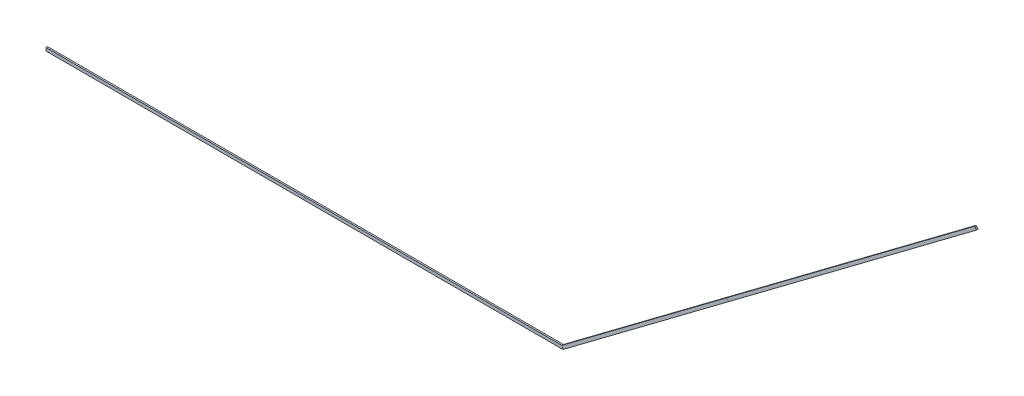
ISO-10303-21;
HEADER;
FILE_DESCRIPTION(('STEP AP214'),'2;1');
FILE_NAME('part.step','',(''),(''),'','','');
FILE_SCHEMA(('AUTOMOTIVE_DESIGN { 1 0 10303 214 1 1 1 1 }'));
ENDSEC;
DATA;
#1=APPLICATION_CONTEXT('core data for automotive mechanical design processes');
#2=APPLICATION_PROTOCOL_DEFINITION('international standard','automotive_design',2000,#1);
#3=PRODUCT_CONTEXT('',#1,'mechanical');
#4=PRODUCT('Part','Part','',(#3));
#5=PRODUCT_RELATED_PRODUCT_CATEGORY('part','',(#4));
#6=PRODUCT_DEFINITION_FORMATION('','',#4);
#7=PRODUCT_DEFINITION_CONTEXT('part definition',#1,'design');
#8=PRODUCT_DEFINITION('design','',#6,#7);
#9=PRODUCT_DEFINITION_SHAPE('','',#8);
#10=(LENGTH_UNIT() NAMED_UNIT(*) SI_UNIT(.MILLI.,.METRE.));
#11=(NAMED_UNIT(*) PLANE_ANGLE_UNIT() SI_UNIT($,.RADIAN.));
#12=(NAMED_UNIT(*) SI_UNIT($,.STERADIAN.) SOLID_ANGLE_UNIT());
#13=UNCERTAINTY_MEASURE_WITH_UNIT(LENGTH_MEASURE(1.E-05),#10,'distance_accuracy_value','');
#14=(GEOMETRIC_REPRESENTATION_CONTEXT(3) GLOBAL_UNCERTAINTY_ASSIGNED_CONTEXT((#13)) GLOBAL_UNIT_ASSIGNED_CONTEXT((#10,
#11,#12)) REPRESENTATION_CONTEXT('',''));
#15=CARTESIAN_POINT('',(0.,0.,0.));
#16=DIRECTION('',(0.,0.,1.));
#17=DIRECTION('',(1.,0.,0.));
#18=AXIS2_PLACEMENT_3D('',#15,#16,#17);
#19=CARTESIAN_POINT('',(9009.,2988.,-7.5));
#20=DIRECTION('',(0.,0.,1.));
#21=DIRECTION('',(1.,0.,0.));
#22=AXIS2_PLACEMENT_3D('',#19,#20,#21);
#23=PLANE('',#22);
#24=DIRECTION('',(-0.600000000000015,0.799999999999989,0.));
#25=VECTOR('',#24,1.);
#26=CARTESIAN_POINT('',(6609.,1188.,-7.5));
#27=LINE('',#26,#25);
#28=CARTESIAN_POINT('',(6609.,1188.,-7.5));
#29=VERTEX_POINT('',#28);
#30=CARTESIAN_POINT('',(6591.,1212.,-7.5));
#31=VERTEX_POINT('',#30);
#32=EDGE_CURVE('E115',#29,#31,#27,.T.);
#33=ORIENTED_EDGE('',*,*,#32,.T.);
#34=DIRECTION('',(-0.8,-0.6,0.));
#35=VECTOR('',#34,1.);
#36=CARTESIAN_POINT('',(8991.,3012.,-7.5));
#37=LINE('',#36,#35);
#38=CARTESIAN_POINT('',(8991.,3012.,-7.5));
#39=VERTEX_POINT('',#38);
#40=EDGE_CURVE('E12',#39,#31,#37,.T.);
#41=ORIENTED_EDGE('',*,*,#40,.F.);
#42=DIRECTION('',(-0.600000000000015,0.799999999999989,0.));
#43=VECTOR('',#42,1.);
#44=CARTESIAN_POINT('',(9009.,2988.,-7.5));
#45=LINE('',#44,#43);
#46=CARTESIAN_POINT('',(9009.,2988.,-7.5));
#47=VERTEX_POINT('',#46);
#48=EDGE_CURVE('E103',#47,#39,#45,.T.);
#49=ORIENTED_EDGE('',*,*,#48,.F.);
#50=DIRECTION('',(-0.8,-0.6,0.));
#51=VECTOR('',#50,1.);
#52=CARTESIAN_POINT('',(9009.,2988.,-7.5));
#53=LINE('',#52,#51);
#54=EDGE_CURVE('E111',#47,#29,#53,.T.);
#55=ORIENTED_EDGE('',*,*,#54,.T.);
#56=EDGE_LOOP('',(#33,#41,#49,#55));
#57=FACE_BOUND('',#56,.T.);
#58=ADVANCED_FACE('F52',(#57),#23,.F.);
#59=CARTESIAN_POINT('',(8991.,3012.,7.5));
#60=DIRECTION('',(0.6,-0.8,0.));
#61=DIRECTION('',(0.8,0.6,0.));
#62=AXIS2_PLACEMENT_3D('',#59,#60,#61);
#63=PLANE('',#62);
#64=DIRECTION('',(0.,0.,1.));
#65=VECTOR('',#64,1.);
#66=CARTESIAN_POINT('',(6591.,1212.,7.5));
#67=LINE('',#66,#65);
#68=CARTESIAN_POINT('',(6591.,1212.,7.5));
#69=VERTEX_POINT('',#68);
#70=EDGE_CURVE('E107',#31,#69,#67,.T.);
#71=ORIENTED_EDGE('',*,*,#70,.T.);
#72=DIRECTION('',(-0.8,-0.6,0.));
#73=VECTOR('',#72,1.);
#74=CARTESIAN_POINT('',(8991.,3012.,7.5));
#75=LINE('',#74,#73);
#76=CARTESIAN_POINT('',(8991.,3012.,7.5));
#77=VERTEX_POINT('',#76);
#78=EDGE_CURVE('E60',#77,#69,#75,.T.);
#79=ORIENTED_EDGE('',*,*,#78,.F.);
#80=DIRECTION('',(0.,0.,1.));
#81=VECTOR('',#80,1.);
#82=CARTESIAN_POINT('',(8991.,3012.,7.5));
#83=LINE('',#82,#81);
#84=EDGE_CURVE('E98',#39,#77,#83,.T.);
#85=ORIENTED_EDGE('',*,*,#84,.F.);
#86=ORIENTED_EDGE('',*,*,#40,.T.);
#87=EDGE_LOOP('',(#71,#79,#85,#86));
#88=FACE_BOUND('',#87,.T.);
#89=ADVANCED_FACE('F106',(#88),#63,.F.);
#90=CARTESIAN_POINT('',(9009.,2988.,7.5));
#91=DIRECTION('',(0.,0.,-1.));
#92=DIRECTION('',(-1.,0.,0.));
#93=AXIS2_PLACEMENT_3D('',#90,#91,#92);
#94=PLANE('',#93);
#95=DIRECTION('',(0.600000000000015,-0.799999999999989,0.));
#96=VECTOR('',#95,1.);
#97=CARTESIAN_POINT('',(6609.,1188.,7.5));
#98=LINE('',#97,#96);
#99=CARTESIAN_POINT('',(6609.,1188.,7.5));
#100=VERTEX_POINT('',#99);
#101=EDGE_CURVE('E85',#69,#100,#98,.T.);
#102=ORIENTED_EDGE('',*,*,#101,.T.);
#103=DIRECTION('',(-0.8,-0.6,0.));
#104=VECTOR('',#103,1.);
#105=CARTESIAN_POINT('',(9009.,2988.,7.5));
#106=LINE('',#105,#104);
#107=CARTESIAN_POINT('',(9009.,2988.,7.5));
#108=VERTEX_POINT('',#107);
#109=EDGE_CURVE('E108',#108,#100,#106,.T.);
#110=ORIENTED_EDGE('',*,*,#109,.F.);
#111=DIRECTION('',(0.600000000000015,-0.799999999999989,0.));
#112=VECTOR('',#111,1.);
#113=CARTESIAN_POINT('',(9009.,2988.,7.5));
#114=LINE('',#113,#112);
#115=EDGE_CURVE('E101',#77,#108,#114,.T.);
#116=ORIENTED_EDGE('',*,*,#115,.F.);
#117=ORIENTED_EDGE('',*,*,#78,.T.);
#118=EDGE_LOOP('',(#102,#110,#116,#117));
#119=FACE_BOUND('',#118,.T.);
#120=ADVANCED_FACE('F109',(#119),#94,.F.);
#121=CARTESIAN_POINT('',(9009.,2988.,7.5));
#122=DIRECTION('',(-0.6,0.8,0.));
#123=DIRECTION('',(-0.8,-0.6,0.));
#124=AXIS2_PLACEMENT_3D('',#121,#122,#123);
#125=PLANE('',#124);
#126=DIRECTION('',(0.,0.,-1.));
#127=VECTOR('',#126,1.);
#128=CARTESIAN_POINT('',(6609.,1188.,7.5));
#129=LINE('',#128,#127);
#130=EDGE_CURVE('E91',#100,#29,#129,.T.);
#131=ORIENTED_EDGE('',*,*,#130,.T.);
#132=ORIENTED_EDGE('',*,*,#54,.F.);
#133=DIRECTION('',(0.,0.,-1.));
#134=VECTOR('',#133,1.);
#135=CARTESIAN_POINT('',(9009.,2988.,7.5));
#136=LINE('',#135,#134);
#137=EDGE_CURVE('E68',#108,#47,#136,.T.);
#138=ORIENTED_EDGE('',*,*,#137,.F.);
#139=ORIENTED_EDGE('',*,*,#109,.T.);
#140=EDGE_LOOP('',(#131,#132,#138,#139));
#141=FACE_BOUND('',#140,.T.);
#142=ADVANCED_FACE('F122',(#141),#125,.F.);
#143=CARTESIAN_POINT('',(7199.99999999991,5400.00000000003,0.));
#144=DIRECTION('',(-0.799999999999989,-0.600000000000015,0.));
#145=DIRECTION('',(0.600000000000015,-0.799999999999989,0.));
#146=AXIS2_PLACEMENT_3D('',#143,#144,#145);
#147=PLANE('',#146);
#148=ORIENTED_EDGE('',*,*,#48,.T.);
#149=ORIENTED_EDGE('',*,*,#84,.T.);
#150=ORIENTED_EDGE('',*,*,#115,.T.);
#151=ORIENTED_EDGE('',*,*,#137,.T.);
#152=EDGE_LOOP('',(#148,#149,#150,#151));
#153=FACE_BOUND('',#152,.T.);
#154=ADVANCED_FACE('F99',(#153),#147,.F.);
#155=CARTESIAN_POINT('',(4799.99999999991,3600.00000000003,0.));
#156=DIRECTION('',(-0.799999999999989,-0.600000000000015,0.));
#157=DIRECTION('',(0.600000000000015,-0.799999999999989,0.));
#158=AXIS2_PLACEMENT_3D('',#155,#156,#157);
#159=PLANE('',#158);
#160=ORIENTED_EDGE('',*,*,#32,.F.);
#161=ORIENTED_EDGE('',*,*,#130,.F.);
#162=ORIENTED_EDGE('',*,*,#101,.F.);
#163=ORIENTED_EDGE('',*,*,#70,.F.);
#164=EDGE_LOOP('',(#160,#161,#162,#163));
#165=FACE_BOUND('',#164,.T.);
#166=ADVANCED_FACE('F125',(#165),#159,.T.);
#167=CLOSED_SHELL('',(#58,#89,#120,#142,#154,#166));
#168=MANIFOLD_SOLID_BREP('B2',#167);
#169=CARTESIAN_POINT('',(6609.,1188.,-7.5));
#170=DIRECTION('',(0.,0.,1.));
#171=DIRECTION('',(1.,0.,0.));
#172=AXIS2_PLACEMENT_3D('',#169,#170,#171);
#173=PLANE('',#172);
#174=DIRECTION('',(-0.600000000000015,0.799999999999989,0.));
#175=VECTOR('',#174,1.);
#176=CARTESIAN_POINT('',(5009.,-12.,-7.5));
#177=LINE('',#176,#175);
#178=CARTESIAN_POINT('',(5009.,-12.,-7.5));
#179=VERTEX_POINT('',#178);
#180=CARTESIAN_POINT('',(4991.,12.,-7.5));
#181=VERTEX_POINT('',#180);
#182=EDGE_CURVE('E249',#179,#181,#177,.T.);
#183=ORIENTED_EDGE('',*,*,#182,.T.);
#184=DIRECTION('',(-0.8,-0.6,0.));
#185=VECTOR('',#184,1.);
#186=CARTESIAN_POINT('',(6591.,1212.,-7.5));
#187=LINE('',#186,#185);
#188=CARTESIAN_POINT('',(6591.,1212.,-7.5));
#189=VERTEX_POINT('',#188);
#190=EDGE_CURVE('E50',#189,#181,#187,.T.);
#191=ORIENTED_EDGE('',*,*,#190,.F.);
#192=DIRECTION('',(-0.600000000000015,0.799999999999989,0.));
#193=VECTOR('',#192,1.);
#194=CARTESIAN_POINT('',(6609.,1188.,-7.5));
#195=LINE('',#194,#193);
#196=CARTESIAN_POINT('',(6609.,1188.,-7.5));
#197=VERTEX_POINT('',#196);
#198=EDGE_CURVE('E237',#197,#189,#195,.T.);
#199=ORIENTED_EDGE('',*,*,#198,.F.);
#200=DIRECTION('',(-0.8,-0.6,0.));
#201=VECTOR('',#200,1.);
#202=CARTESIAN_POINT('',(6609.,1188.,-7.5));
#203=LINE('',#202,#201);
#204=EDGE_CURVE('E245',#197,#179,#203,.T.);
#205=ORIENTED_EDGE('',*,*,#204,.T.);
#206=EDGE_LOOP('',(#183,#191,#199,#205));
#207=FACE_BOUND('',#206,.T.);
#208=ADVANCED_FACE('F186',(#207),#173,.F.);
#209=CARTESIAN_POINT('',(6591.,1212.,7.5));
#210=DIRECTION('',(0.6,-0.8,0.));
#211=DIRECTION('',(0.8,0.6,0.));
#212=AXIS2_PLACEMENT_3D('',#209,#210,#211);
#213=PLANE('',#212);
#214=DIRECTION('',(0.,0.,1.));
#215=VECTOR('',#214,1.);
#216=CARTESIAN_POINT('',(4991.,12.,7.5));
#217=LINE('',#216,#215);
#218=CARTESIAN_POINT('',(4991.,12.,7.5));
#219=VERTEX_POINT('',#218);
#220=EDGE_CURVE('E241',#181,#219,#217,.T.);
#221=ORIENTED_EDGE('',*,*,#220,.T.);
#222=DIRECTION('',(-0.8,-0.6,0.));
#223=VECTOR('',#222,1.);
#224=CARTESIAN_POINT('',(6591.,1212.,7.5));
#225=LINE('',#224,#223);
#226=CARTESIAN_POINT('',(6591.,1212.,7.5));
#227=VERTEX_POINT('',#226);
#228=EDGE_CURVE('E194',#227,#219,#225,.T.);
#229=ORIENTED_EDGE('',*,*,#228,.F.);
#230=DIRECTION('',(0.,0.,1.));
#231=VECTOR('',#230,1.);
#232=CARTESIAN_POINT('',(6591.,1212.,7.5));
#233=LINE('',#232,#231);
#234=EDGE_CURVE('E232',#189,#227,#233,.T.);
#235=ORIENTED_EDGE('',*,*,#234,.F.);
#236=ORIENTED_EDGE('',*,*,#190,.T.);
#237=EDGE_LOOP('',(#221,#229,#235,#236));
#238=FACE_BOUND('',#237,.T.);
#239=ADVANCED_FACE('F240',(#238),#213,.F.);
#240=CARTESIAN_POINT('',(6609.,1188.,7.5));
#241=DIRECTION('',(0.,0.,-1.));
#242=DIRECTION('',(-1.,0.,0.));
#243=AXIS2_PLACEMENT_3D('',#240,#241,#242);
#244=PLANE('',#243);
#245=DIRECTION('',(0.600000000000015,-0.799999999999989,0.));
#246=VECTOR('',#245,1.);
#247=CARTESIAN_POINT('',(5009.,-12.,7.5));
#248=LINE('',#247,#246);
#249=CARTESIAN_POINT('',(5009.,-12.,7.5));
#250=VERTEX_POINT('',#249);
#251=EDGE_CURVE('E219',#219,#250,#248,.T.);
#252=ORIENTED_EDGE('',*,*,#251,.T.);
#253=DIRECTION('',(-0.8,-0.6,0.));
#254=VECTOR('',#253,1.);
#255=CARTESIAN_POINT('',(6609.,1188.,7.5));
#256=LINE('',#255,#254);
#257=CARTESIAN_POINT('',(6609.,1188.,7.5));
#258=VERTEX_POINT('',#257);
#259=EDGE_CURVE('E242',#258,#250,#256,.T.);
#260=ORIENTED_EDGE('',*,*,#259,.F.);
#261=DIRECTION('',(0.600000000000015,-0.799999999999989,0.));
#262=VECTOR('',#261,1.);
#263=CARTESIAN_POINT('',(6609.,1188.,7.5));
#264=LINE('',#263,#262);
#265=EDGE_CURVE('E235',#227,#258,#264,.T.);
#266=ORIENTED_EDGE('',*,*,#265,.F.);
#267=ORIENTED_EDGE('',*,*,#228,.T.);
#268=EDGE_LOOP('',(#252,#260,#266,#267));
#269=FACE_BOUND('',#268,.T.);
#270=ADVANCED_FACE('F243',(#269),#244,.F.);
#271=CARTESIAN_POINT('',(6609.,1188.,7.5));
#272=DIRECTION('',(-0.6,0.8,0.));
#273=DIRECTION('',(-0.8,-0.6,0.));
#274=AXIS2_PLACEMENT_3D('',#271,#272,#273);
#275=PLANE('',#274);
#276=DIRECTION('',(0.,0.,-1.));
#277=VECTOR('',#276,1.);
#278=CARTESIAN_POINT('',(5009.,-12.,7.5));
#279=LINE('',#278,#277);
#280=EDGE_CURVE('E225',#250,#179,#279,.T.);
#281=ORIENTED_EDGE('',*,*,#280,.T.);
#282=ORIENTED_EDGE('',*,*,#204,.F.);
#283=DIRECTION('',(0.,0.,-1.));
#284=VECTOR('',#283,1.);
#285=CARTESIAN_POINT('',(6609.,1188.,7.5));
#286=LINE('',#285,#284);
#287=EDGE_CURVE('E202',#258,#197,#286,.T.);
#288=ORIENTED_EDGE('',*,*,#287,.F.);
#289=ORIENTED_EDGE('',*,*,#259,.T.);
#290=EDGE_LOOP('',(#281,#282,#288,#289));
#291=FACE_BOUND('',#290,.T.);
#292=ADVANCED_FACE('F256',(#291),#275,.F.);
#293=CARTESIAN_POINT('',(4799.99999999991,3600.00000000003,0.));
#294=DIRECTION('',(-0.799999999999989,-0.600000000000015,0.));
#295=DIRECTION('',(0.600000000000015,-0.799999999999989,0.));
#296=AXIS2_PLACEMENT_3D('',#293,#294,#295);
#297=PLANE('',#296);
#298=ORIENTED_EDGE('',*,*,#198,.T.);
#299=ORIENTED_EDGE('',*,*,#234,.T.);
#300=ORIENTED_EDGE('',*,*,#265,.T.);
#301=ORIENTED_EDGE('',*,*,#287,.T.);
#302=EDGE_LOOP('',(#298,#299,#300,#301));
#303=FACE_BOUND('',#302,.T.);
#304=ADVANCED_FACE('F233',(#303),#297,.F.);
#305=CARTESIAN_POINT('',(3199.99999999991,2400.00000000003,0.));
#306=DIRECTION('',(-0.799999999999989,-0.600000000000015,0.));
#307=DIRECTION('',(0.600000000000015,-0.799999999999989,0.));
#308=AXIS2_PLACEMENT_3D('',#305,#306,#307);
#309=PLANE('',#308);
#310=ORIENTED_EDGE('',*,*,#182,.F.);
#311=ORIENTED_EDGE('',*,*,#280,.F.);
#312=ORIENTED_EDGE('',*,*,#251,.F.);
#313=ORIENTED_EDGE('',*,*,#220,.F.);
#314=EDGE_LOOP('',(#310,#311,#312,#313));
#315=FACE_BOUND('',#314,.T.);
#316=ADVANCED_FACE('F259',(#315),#309,.T.);
#317=CLOSED_SHELL('',(#208,#239,#270,#292,#304,#316));
#318=MANIFOLD_SOLID_BREP('B6',#317);
#319=CARTESIAN_POINT('',(5000.,-15.,-7.5));
#320=DIRECTION('',(0.,0.,1.));
#321=DIRECTION('',(1.,0.,0.));
#322=AXIS2_PLACEMENT_3D('',#319,#320,#321);
#323=PLANE('',#322);
#324=DIRECTION('',(0.,1.,0.));
#325=VECTOR('',#324,1.);
#326=CARTESIAN_POINT('',(2500.,-15.,-7.5));
#327=LINE('',#326,#325);
#328=CARTESIAN_POINT('',(2500.,-15.,-7.5));
#329=VERTEX_POINT('',#328);
#330=CARTESIAN_POINT('',(2500.,15.,-7.5));
#331=VERTEX_POINT('',#330);
#332=EDGE_CURVE('E383',#329,#331,#327,.T.);
#333=ORIENTED_EDGE('',*,*,#332,.T.);
#334=DIRECTION('',(-1.,0.,0.));
#335=VECTOR('',#334,1.);
#336=CARTESIAN_POINT('',(5000.,15.,-7.5));
#337=LINE('',#336,#335);
#338=CARTESIAN_POINT('',(5000.,15.,-7.5));
#339=VERTEX_POINT('',#338);
#340=EDGE_CURVE('E184',#339,#331,#337,.T.);
#341=ORIENTED_EDGE('',*,*,#340,.F.);
#342=DIRECTION('',(0.,1.,0.));
#343=VECTOR('',#342,1.);
#344=CARTESIAN_POINT('',(5000.,-15.,-7.5));
#345=LINE('',#344,#343);
#346=CARTESIAN_POINT('',(5000.,-15.,-7.5));
#347=VERTEX_POINT('',#346);
#348=EDGE_CURVE('E371',#347,#339,#345,.T.);
#349=ORIENTED_EDGE('',*,*,#348,.F.);
#350=DIRECTION('',(-1.,0.,0.));
#351=VECTOR('',#350,1.);
#352=CARTESIAN_POINT('',(5000.,-15.,-7.5));
#353=LINE('',#352,#351);
#354=EDGE_CURVE('E379',#347,#329,#353,.T.);
#355=ORIENTED_EDGE('',*,*,#354,.T.);
#356=EDGE_LOOP('',(#333,#341,#349,#355));
#357=FACE_BOUND('',#356,.T.);
#358=ADVANCED_FACE('F319',(#357),#323,.F.);
#359=CARTESIAN_POINT('',(5000.,15.,7.5));
#360=DIRECTION('',(0.,-1.,0.));
#361=DIRECTION('',(0.,0.,-1.));
#362=AXIS2_PLACEMENT_3D('',#359,#360,#361);
#363=PLANE('',#362);
#364=DIRECTION('',(0.,0.,1.));
#365=VECTOR('',#364,1.);
#366=CARTESIAN_POINT('',(2500.,15.,7.5));
#367=LINE('',#366,#365);
#368=CARTESIAN_POINT('',(2500.,15.,7.5));
#369=VERTEX_POINT('',#368);
#370=EDGE_CURVE('E375',#331,#369,#367,.T.);
#371=ORIENTED_EDGE('',*,*,#370,.T.);
#372=DIRECTION('',(-1.,0.,0.));
#373=VECTOR('',#372,1.);
#374=CARTESIAN_POINT('',(5000.,15.,7.5));
#375=LINE('',#374,#373);
#376=CARTESIAN_POINT('',(5000.,15.,7.5));
#377=VERTEX_POINT('',#376);
#378=EDGE_CURVE('E327',#377,#369,#375,.T.);
#379=ORIENTED_EDGE('',*,*,#378,.F.);
#380=DIRECTION('',(0.,0.,1.));
#381=VECTOR('',#380,1.);
#382=CARTESIAN_POINT('',(5000.,15.,7.5));
#383=LINE('',#382,#381);
#384=EDGE_CURVE('E366',#339,#377,#383,.T.);
#385=ORIENTED_EDGE('',*,*,#384,.F.);
#386=ORIENTED_EDGE('',*,*,#340,.T.);
#387=EDGE_LOOP('',(#371,#379,#385,#386));
#388=FACE_BOUND('',#387,.T.);
#389=ADVANCED_FACE('F374',(#388),#363,.F.);
#390=CARTESIAN_POINT('',(5000.,-15.,7.5));
#391=DIRECTION('',(0.,0.,-1.));
#392=DIRECTION('',(-1.,0.,0.));
#393=AXIS2_PLACEMENT_3D('',#390,#391,#392);
#394=PLANE('',#393);
#395=DIRECTION('',(0.,-1.,0.));
#396=VECTOR('',#395,1.);
#397=CARTESIAN_POINT('',(2500.,-15.,7.5));
#398=LINE('',#397,#396);
#399=CARTESIAN_POINT('',(2500.,-15.,7.5));
#400=VERTEX_POINT('',#399);
#401=EDGE_CURVE('E353',#369,#400,#398,.T.);
#402=ORIENTED_EDGE('',*,*,#401,.T.);
#403=DIRECTION('',(-1.,0.,0.));
#404=VECTOR('',#403,1.);
#405=CARTESIAN_POINT('',(5000.,-15.,7.5));
#406=LINE('',#405,#404);
#407=CARTESIAN_POINT('',(5000.,-15.,7.5));
#408=VERTEX_POINT('',#407);
#409=EDGE_CURVE('E376',#408,#400,#406,.T.);
#410=ORIENTED_EDGE('',*,*,#409,.F.);
#411=DIRECTION('',(0.,-1.,0.));
#412=VECTOR('',#411,1.);
#413=CARTESIAN_POINT('',(5000.,-15.,7.5));
#414=LINE('',#413,#412);
#415=EDGE_CURVE('E369',#377,#408,#414,.T.);
#416=ORIENTED_EDGE('',*,*,#415,.F.);
#417=ORIENTED_EDGE('',*,*,#378,.T.);
#418=EDGE_LOOP('',(#402,#410,#416,#417));
#419=FACE_BOUND('',#418,.T.);
#420=ADVANCED_FACE('F377',(#419),#394,.F.);
#421=CARTESIAN_POINT('',(5000.,-15.,7.5));
#422=DIRECTION('',(0.,1.,0.));
#423=DIRECTION('',(0.,0.,1.));
#424=AXIS2_PLACEMENT_3D('',#421,#422,#423);
#425=PLANE('',#424);
#426=DIRECTION('',(0.,0.,-1.));
#427=VECTOR('',#426,1.);
#428=CARTESIAN_POINT('',(2500.,-15.,7.5));
#429=LINE('',#428,#427);
#430=EDGE_CURVE('E359',#400,#329,#429,.T.);
#431=ORIENTED_EDGE('',*,*,#430,.T.);
#432=ORIENTED_EDGE('',*,*,#354,.F.);
#433=DIRECTION('',(0.,0.,-1.));
#434=VECTOR('',#433,1.);
#435=CARTESIAN_POINT('',(5000.,-15.,7.5));
#436=LINE('',#435,#434);
#437=EDGE_CURVE('E335',#408,#347,#436,.T.);
#438=ORIENTED_EDGE('',*,*,#437,.F.);
#439=ORIENTED_EDGE('',*,*,#409,.T.);
#440=EDGE_LOOP('',(#431,#432,#438,#439));
#441=FACE_BOUND('',#440,.T.);
#442=ADVANCED_FACE('F390',(#441),#425,.F.);
#443=CARTESIAN_POINT('',(5000.,0.,0.));
#444=DIRECTION('',(-1.,0.,0.));
#445=DIRECTION('',(0.,0.,1.));
#446=AXIS2_PLACEMENT_3D('',#443,#444,#445);
#447=PLANE('',#446);
#448=ORIENTED_EDGE('',*,*,#348,.T.);
#449=ORIENTED_EDGE('',*,*,#384,.T.);
#450=ORIENTED_EDGE('',*,*,#415,.T.);
#451=ORIENTED_EDGE('',*,*,#437,.T.);
#452=EDGE_LOOP('',(#448,#449,#450,#451));
#453=FACE_BOUND('',#452,.T.);
#454=ADVANCED_FACE('F367',(#453),#447,.F.);
#455=CARTESIAN_POINT('',(2500.,0.,0.));
#456=DIRECTION('',(-1.,0.,0.));
#457=DIRECTION('',(0.,0.,1.));
#458=AXIS2_PLACEMENT_3D('',#455,#456,#457);
#459=PLANE('',#458);
#460=ORIENTED_EDGE('',*,*,#332,.F.);
#461=ORIENTED_EDGE('',*,*,#430,.F.);
#462=ORIENTED_EDGE('',*,*,#401,.F.);
#463=ORIENTED_EDGE('',*,*,#370,.F.);
#464=EDGE_LOOP('',(#460,#461,#462,#463));
#465=FACE_BOUND('',#464,.T.);
#466=ADVANCED_FACE('F393',(#465),#459,.T.);
#467=CLOSED_SHELL('',(#358,#389,#420,#442,#454,#466));
#468=MANIFOLD_SOLID_BREP('B44',#467);
#469=CARTESIAN_POINT('',(2500.,-15.,-7.5));
#470=DIRECTION('',(0.,0.,1.));
#471=DIRECTION('',(1.,0.,0.));
#472=AXIS2_PLACEMENT_3D('',#469,#470,#471);
#473=PLANE('',#472);
#474=DIRECTION('',(0.,1.,0.));
#475=VECTOR('',#474,1.);
#476=CARTESIAN_POINT('',(0.,-15.,-7.5));
#477=LINE('',#476,#475);
#478=CARTESIAN_POINT('',(0.,-15.,-7.5));
#479=VERTEX_POINT('',#478);
#480=CARTESIAN_POINT('',(0.,15.,-7.5));
#481=VERTEX_POINT('',#480);
#482=EDGE_CURVE('E507',#479,#481,#477,.T.);
#483=ORIENTED_EDGE('',*,*,#482,.T.);
#484=DIRECTION('',(-1.,0.,0.));
#485=VECTOR('',#484,1.);
#486=CARTESIAN_POINT('',(2500.,15.,-7.5));
#487=LINE('',#486,#485);
#488=CARTESIAN_POINT('',(2500.,15.,-7.5));
#489=VERTEX_POINT('',#488);
#490=EDGE_CURVE('E317',#489,#481,#487,.T.);
#491=ORIENTED_EDGE('',*,*,#490,.F.);
#492=DIRECTION('',(0.,1.,0.));
#493=VECTOR('',#492,1.);
#494=CARTESIAN_POINT('',(2500.,-15.,-7.5));
#495=LINE('',#494,#493);
#496=CARTESIAN_POINT('',(2500.,-15.,-7.5));
#497=VERTEX_POINT('',#496);
#498=EDGE_CURVE('E495',#497,#489,#495,.T.);
#499=ORIENTED_EDGE('',*,*,#498,.F.);
#500=DIRECTION('',(-1.,0.,0.));
#501=VECTOR('',#500,1.);
#502=CARTESIAN_POINT('',(2500.,-15.,-7.5));
#503=LINE('',#502,#501);
#504=EDGE_CURVE('E503',#497,#479,#503,.T.);
#505=ORIENTED_EDGE('',*,*,#504,.T.);
#506=EDGE_LOOP('',(#483,#491,#499,#505));
#507=FACE_BOUND('',#506,.T.);
#508=ADVANCED_FACE('F444',(#507),#473,.F.);
#509=CARTESIAN_POINT('',(2500.,15.,7.5));
#510=DIRECTION('',(0.,-1.,0.));
#511=DIRECTION('',(0.,0.,-1.));
#512=AXIS2_PLACEMENT_3D('',#509,#510,#511);
#513=PLANE('',#512);
#514=DIRECTION('',(0.,0.,1.));
#515=VECTOR('',#514,1.);
#516=CARTESIAN_POINT('',(0.,15.,7.5));
#517=LINE('',#516,#515);
#518=CARTESIAN_POINT('',(0.,15.,7.5));
#519=VERTEX_POINT('',#518);
#520=EDGE_CURVE('E499',#481,#519,#517,.T.);
#521=ORIENTED_EDGE('',*,*,#520,.T.);
#522=DIRECTION('',(-1.,0.,0.));
#523=VECTOR('',#522,1.);
#524=CARTESIAN_POINT('',(2500.,15.,7.5));
#525=LINE('',#524,#523);
#526=CARTESIAN_POINT('',(2500.,15.,7.5));
#527=VERTEX_POINT('',#526);
#528=EDGE_CURVE('E452',#527,#519,#525,.T.);
#529=ORIENTED_EDGE('',*,*,#528,.F.);
#530=DIRECTION('',(0.,0.,1.));
#531=VECTOR('',#530,1.);
#532=CARTESIAN_POINT('',(2500.,15.,7.5));
#533=LINE('',#532,#531);
#534=EDGE_CURVE('E490',#489,#527,#533,.T.);
#535=ORIENTED_EDGE('',*,*,#534,.F.);
#536=ORIENTED_EDGE('',*,*,#490,.T.);
#537=EDGE_LOOP('',(#521,#529,#535,#536));
#538=FACE_BOUND('',#537,.T.);
#539=ADVANCED_FACE('F498',(#538),#513,.F.);
#540=CARTESIAN_POINT('',(2500.,-15.,7.5));
#541=DIRECTION('',(0.,0.,-1.));
#542=DIRECTION('',(-1.,0.,0.));
#543=AXIS2_PLACEMENT_3D('',#540,#541,#542);
#544=PLANE('',#543);
#545=DIRECTION('',(0.,-1.,0.));
#546=VECTOR('',#545,1.);
#547=CARTESIAN_POINT('',(0.,-15.,7.5));
#548=LINE('',#547,#546);
#549=CARTESIAN_POINT('',(0.,-15.,7.5));
#550=VERTEX_POINT('',#549);
#551=EDGE_CURVE('E477',#519,#550,#548,.T.);
#552=ORIENTED_EDGE('',*,*,#551,.T.);
#553=DIRECTION('',(-1.,0.,0.));
#554=VECTOR('',#553,1.);
#555=CARTESIAN_POINT('',(2500.,-15.,7.5));
#556=LINE('',#555,#554);
#557=CARTESIAN_POINT('',(2500.,-15.,7.5));
#558=VERTEX_POINT('',#557);
#559=EDGE_CURVE('E500',#558,#550,#556,.T.);
#560=ORIENTED_EDGE('',*,*,#559,.F.);
#561=DIRECTION('',(0.,-1.,0.));
#562=VECTOR('',#561,1.);
#563=CARTESIAN_POINT('',(2500.,-15.,7.5));
#564=LINE('',#563,#562);
#565=EDGE_CURVE('E493',#527,#558,#564,.T.);
#566=ORIENTED_EDGE('',*,*,#565,.F.);
#567=ORIENTED_EDGE('',*,*,#528,.T.);
#568=EDGE_LOOP('',(#552,#560,#566,#567));
#569=FACE_BOUND('',#568,.T.);
#570=ADVANCED_FACE('F501',(#569),#544,.F.);
#571=CARTESIAN_POINT('',(2500.,-15.,7.5));
#572=DIRECTION('',(0.,1.,0.));
#573=DIRECTION('',(0.,0.,1.));
#574=AXIS2_PLACEMENT_3D('',#571,#572,#573);
#575=PLANE('',#574);
#576=DIRECTION('',(0.,0.,-1.));
#577=VECTOR('',#576,1.);
#578=CARTESIAN_POINT('',(0.,-15.,7.5));
#579=LINE('',#578,#577);
#580=EDGE_CURVE('E483',#550,#479,#579,.T.);
#581=ORIENTED_EDGE('',*,*,#580,.T.);
#582=ORIENTED_EDGE('',*,*,#504,.F.);
#583=DIRECTION('',(0.,0.,-1.));
#584=VECTOR('',#583,1.);
#585=CARTESIAN_POINT('',(2500.,-15.,7.5));
#586=LINE('',#585,#584);
#587=EDGE_CURVE('E460',#558,#497,#586,.T.);
#588=ORIENTED_EDGE('',*,*,#587,.F.);
#589=ORIENTED_EDGE('',*,*,#559,.T.);
#590=EDGE_LOOP('',(#581,#582,#588,#589));
#591=FACE_BOUND('',#590,.T.);
#592=ADVANCED_FACE('F514',(#591),#575,.F.);
#593=CARTESIAN_POINT('',(2500.,0.,0.));
#594=DIRECTION('',(-1.,0.,0.));
#595=DIRECTION('',(0.,0.,1.));
#596=AXIS2_PLACEMENT_3D('',#593,#594,#595);
#597=PLANE('',#596);
#598=ORIENTED_EDGE('',*,*,#498,.T.);
#599=ORIENTED_EDGE('',*,*,#534,.T.);
#600=ORIENTED_EDGE('',*,*,#565,.T.);
#601=ORIENTED_EDGE('',*,*,#587,.T.);
#602=EDGE_LOOP('',(#598,#599,#600,#601));
#603=FACE_BOUND('',#602,.T.);
#604=ADVANCED_FACE('F491',(#603),#597,.F.);
#605=CARTESIAN_POINT('',(0.,0.,0.));
#606=DIRECTION('',(-1.,0.,0.));
#607=DIRECTION('',(0.,0.,1.));
#608=AXIS2_PLACEMENT_3D('',#605,#606,#607);
#609=PLANE('',#608);
#610=ORIENTED_EDGE('',*,*,#482,.F.);
#611=ORIENTED_EDGE('',*,*,#580,.F.);
#612=ORIENTED_EDGE('',*,*,#551,.F.);
#613=ORIENTED_EDGE('',*,*,#520,.F.);
#614=EDGE_LOOP('',(#610,#611,#612,#613));
#615=FACE_BOUND('',#614,.T.);
#616=ADVANCED_FACE('F517',(#615),#609,.T.);
#617=CLOSED_SHELL('',(#508,#539,#570,#592,#604,#616));
#618=MANIFOLD_SOLID_BREP('B178',#617);
#619=ADVANCED_BREP_SHAPE_REPRESENTATION('',(#18,#168,#318,#468,#618),#14);
#620=SHAPE_DEFINITION_REPRESENTATION(#9,#619);
ENDSEC;
END-ISO-10303-21;
